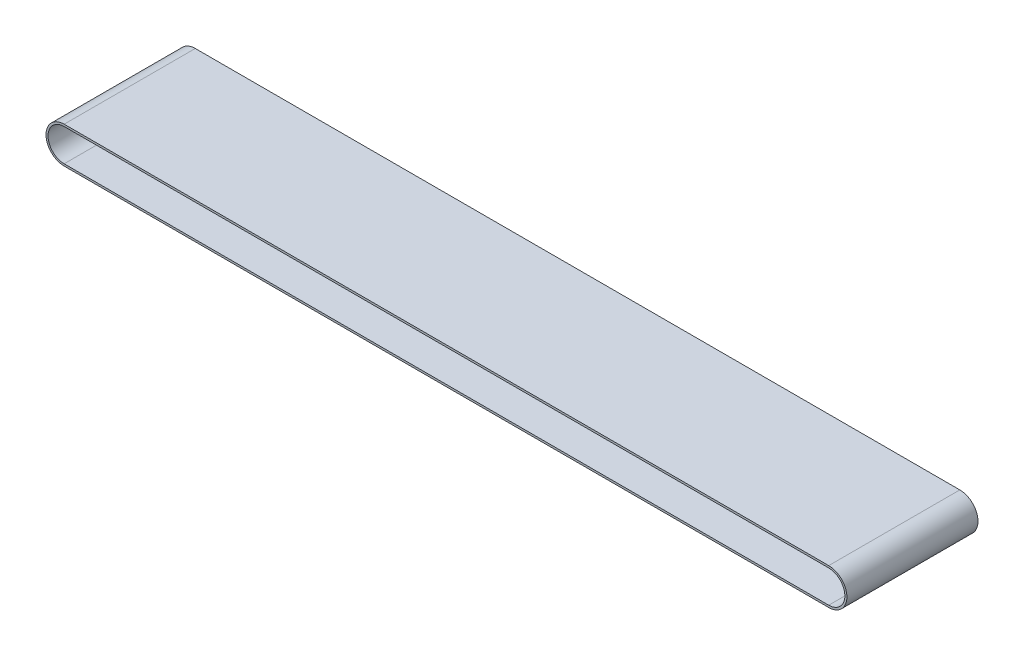
ISO-10303-21;
HEADER;
FILE_DESCRIPTION(('STEP AP214'),'2;1');
FILE_NAME('part.step','',(''),(''),'','','');
FILE_SCHEMA(('AUTOMOTIVE_DESIGN { 1 0 10303 214 1 1 1 1 }'));
ENDSEC;
DATA;
#1=APPLICATION_CONTEXT('core data for automotive mechanical design processes');
#2=APPLICATION_PROTOCOL_DEFINITION('international standard','automotive_design',2000,#1);
#3=PRODUCT_CONTEXT('',#1,'mechanical');
#4=PRODUCT('Part','Part','',(#3));
#5=PRODUCT_RELATED_PRODUCT_CATEGORY('part','',(#4));
#6=PRODUCT_DEFINITION_FORMATION('','',#4);
#7=PRODUCT_DEFINITION_CONTEXT('part definition',#1,'design');
#8=PRODUCT_DEFINITION('design','',#6,#7);
#9=PRODUCT_DEFINITION_SHAPE('','',#8);
#10=(LENGTH_UNIT() NAMED_UNIT(*) SI_UNIT(.MILLI.,.METRE.));
#11=(NAMED_UNIT(*) PLANE_ANGLE_UNIT() SI_UNIT($,.RADIAN.));
#12=(NAMED_UNIT(*) SI_UNIT($,.STERADIAN.) SOLID_ANGLE_UNIT());
#13=UNCERTAINTY_MEASURE_WITH_UNIT(LENGTH_MEASURE(1.E-05),#10,'distance_accuracy_value','');
#14=(GEOMETRIC_REPRESENTATION_CONTEXT(3) GLOBAL_UNCERTAINTY_ASSIGNED_CONTEXT((#13)) GLOBAL_UNIT_ASSIGNED_CONTEXT((#10,
#11,#12)) REPRESENTATION_CONTEXT('',''));
#15=CARTESIAN_POINT('',(0.,0.,0.));
#16=DIRECTION('',(0.,0.,1.));
#17=DIRECTION('',(1.,0.,0.));
#18=AXIS2_PLACEMENT_3D('',#15,#16,#17);
#19=CARTESIAN_POINT('',(0.,-16.,130.));
#20=DIRECTION('',(0.,0.,1.));
#21=DIRECTION('',(1.,0.,0.));
#22=AXIS2_PLACEMENT_3D('',#19,#20,#21);
#23=PLANE('',#22);
#24=CARTESIAN_POINT('',(0.,-16.,130.));
#25=DIRECTION('',(0.,0.,1.));
#26=DIRECTION('',(1.,0.,0.));
#27=AXIS2_PLACEMENT_3D('',#24,#25,#26);
#28=CIRCLE('',#27,18.);
#29=CARTESIAN_POINT('',(0.,2.,130.));
#30=VERTEX_POINT('',#29);
#31=CARTESIAN_POINT('',(0.,-34.,130.));
#32=VERTEX_POINT('',#31);
#33=EDGE_CURVE('E146',#30,#32,#28,.T.);
#34=ORIENTED_EDGE('',*,*,#33,.T.);
#35=DIRECTION('',(1.,0.,0.));
#36=VECTOR('',#35,1.);
#37=CARTESIAN_POINT('',(0.,-34.,130.));
#38=LINE('',#37,#36);
#39=CARTESIAN_POINT('',(758.,-34.,130.));
#40=VERTEX_POINT('',#39);
#41=EDGE_CURVE('E149',#32,#40,#38,.T.);
#42=ORIENTED_EDGE('',*,*,#41,.T.);
#43=CARTESIAN_POINT('',(758.,-16.,130.));
#44=DIRECTION('',(0.,0.,1.));
#45=DIRECTION('',(-1.,0.,0.));
#46=AXIS2_PLACEMENT_3D('',#43,#44,#45);
#47=CIRCLE('',#46,18.);
#48=CARTESIAN_POINT('',(758.,1.99999999999999,130.));
#49=VERTEX_POINT('',#48);
#50=EDGE_CURVE('E152',#40,#49,#47,.T.);
#51=ORIENTED_EDGE('',*,*,#50,.T.);
#52=DIRECTION('',(-1.,0.,0.));
#53=VECTOR('',#52,1.);
#54=CARTESIAN_POINT('',(0.,2.,130.));
#55=LINE('',#54,#53);
#56=EDGE_CURVE('E154',#49,#30,#55,.T.);
#57=ORIENTED_EDGE('',*,*,#56,.T.);
#58=EDGE_LOOP('',(#34,#42,#51,#57));
#59=FACE_BOUND('',#58,.T.);
#60=DIRECTION('',(1.,0.,0.));
#61=VECTOR('',#60,1.);
#62=CARTESIAN_POINT('',(0.,-32.,130.));
#63=LINE('',#62,#61);
#64=CARTESIAN_POINT('',(0.,-32.,130.));
#65=VERTEX_POINT('',#64);
#66=CARTESIAN_POINT('',(758.,-32.,130.));
#67=VERTEX_POINT('',#66);
#68=EDGE_CURVE('E118',#65,#67,#63,.T.);
#69=ORIENTED_EDGE('',*,*,#68,.F.);
#70=CARTESIAN_POINT('',(0.,-16.,130.));
#71=DIRECTION('',(0.,0.,1.));
#72=DIRECTION('',(1.,0.,0.));
#73=AXIS2_PLACEMENT_3D('',#70,#71,#72);
#74=CIRCLE('',#73,16.);
#75=CARTESIAN_POINT('',(0.,0.,130.));
#76=VERTEX_POINT('',#75);
#77=EDGE_CURVE('E110',#76,#65,#74,.T.);
#78=ORIENTED_EDGE('',*,*,#77,.F.);
#79=DIRECTION('',(-1.,0.,0.));
#80=VECTOR('',#79,1.);
#81=CARTESIAN_POINT('',(0.,0.,130.));
#82=LINE('',#81,#80);
#83=CARTESIAN_POINT('',(758.,0.,130.));
#84=VERTEX_POINT('',#83);
#85=EDGE_CURVE('E132',#84,#76,#82,.T.);
#86=ORIENTED_EDGE('',*,*,#85,.F.);
#87=CARTESIAN_POINT('',(758.,-16.,130.));
#88=DIRECTION('',(0.,0.,1.));
#89=DIRECTION('',(-1.,0.,0.));
#90=AXIS2_PLACEMENT_3D('',#87,#88,#89);
#91=CIRCLE('',#90,16.);
#92=EDGE_CURVE('E130',#67,#84,#91,.T.);
#93=ORIENTED_EDGE('',*,*,#92,.F.);
#94=EDGE_LOOP('',(#69,#78,#86,#93));
#95=FACE_BOUND('',#94,.T.);
#96=ADVANCED_FACE('F45',(#59,#95),#23,.T.);
#97=CARTESIAN_POINT('',(0.,-16.,0.));
#98=DIRECTION('',(0.,0.,1.));
#99=DIRECTION('',(1.,0.,0.));
#100=AXIS2_PLACEMENT_3D('',#97,#98,#99);
#101=PLANE('',#100);
#102=CARTESIAN_POINT('',(0.,-16.,0.));
#103=DIRECTION('',(0.,0.,1.));
#104=DIRECTION('',(1.,0.,0.));
#105=AXIS2_PLACEMENT_3D('',#102,#103,#104);
#106=CIRCLE('',#105,18.);
#107=CARTESIAN_POINT('',(0.,2.,0.));
#108=VERTEX_POINT('',#107);
#109=CARTESIAN_POINT('',(0.,-34.,0.));
#110=VERTEX_POINT('',#109);
#111=EDGE_CURVE('E126',#108,#110,#106,.T.);
#112=ORIENTED_EDGE('',*,*,#111,.F.);
#113=DIRECTION('',(-1.,0.,0.));
#114=VECTOR('',#113,1.);
#115=CARTESIAN_POINT('',(0.,2.,0.));
#116=LINE('',#115,#114);
#117=CARTESIAN_POINT('',(758.,1.99999999999999,0.));
#118=VERTEX_POINT('',#117);
#119=EDGE_CURVE('E150',#118,#108,#116,.T.);
#120=ORIENTED_EDGE('',*,*,#119,.F.);
#121=CARTESIAN_POINT('',(758.,-16.,0.));
#122=DIRECTION('',(0.,0.,1.));
#123=DIRECTION('',(-1.,0.,0.));
#124=AXIS2_PLACEMENT_3D('',#121,#122,#123);
#125=CIRCLE('',#124,18.);
#126=CARTESIAN_POINT('',(758.,-34.,0.));
#127=VERTEX_POINT('',#126);
#128=EDGE_CURVE('E161',#127,#118,#125,.T.);
#129=ORIENTED_EDGE('',*,*,#128,.F.);
#130=DIRECTION('',(1.,0.,0.));
#131=VECTOR('',#130,1.);
#132=CARTESIAN_POINT('',(0.,-34.,0.));
#133=LINE('',#132,#131);
#134=EDGE_CURVE('E159',#110,#127,#133,.T.);
#135=ORIENTED_EDGE('',*,*,#134,.F.);
#136=EDGE_LOOP('',(#112,#120,#129,#135));
#137=FACE_BOUND('',#136,.T.);
#138=CARTESIAN_POINT('',(0.,-16.,0.));
#139=DIRECTION('',(0.,0.,1.));
#140=DIRECTION('',(1.,0.,0.));
#141=AXIS2_PLACEMENT_3D('',#138,#139,#140);
#142=CIRCLE('',#141,16.);
#143=CARTESIAN_POINT('',(0.,0.,0.));
#144=VERTEX_POINT('',#143);
#145=CARTESIAN_POINT('',(0.,-32.,0.));
#146=VERTEX_POINT('',#145);
#147=EDGE_CURVE('E68',#144,#146,#142,.T.);
#148=ORIENTED_EDGE('',*,*,#147,.T.);
#149=DIRECTION('',(1.,0.,0.));
#150=VECTOR('',#149,1.);
#151=CARTESIAN_POINT('',(0.,-32.,0.));
#152=LINE('',#151,#150);
#153=CARTESIAN_POINT('',(758.,-32.,0.));
#154=VERTEX_POINT('',#153);
#155=EDGE_CURVE('E125',#146,#154,#152,.T.);
#156=ORIENTED_EDGE('',*,*,#155,.T.);
#157=CARTESIAN_POINT('',(758.,-16.,0.));
#158=DIRECTION('',(0.,0.,1.));
#159=DIRECTION('',(-1.,0.,0.));
#160=AXIS2_PLACEMENT_3D('',#157,#158,#159);
#161=CIRCLE('',#160,16.);
#162=CARTESIAN_POINT('',(758.,0.,0.));
#163=VERTEX_POINT('',#162);
#164=EDGE_CURVE('E138',#154,#163,#161,.T.);
#165=ORIENTED_EDGE('',*,*,#164,.T.);
#166=DIRECTION('',(-1.,0.,0.));
#167=VECTOR('',#166,1.);
#168=CARTESIAN_POINT('',(0.,0.,0.));
#169=LINE('',#168,#167);
#170=EDGE_CURVE('E119',#163,#144,#169,.T.);
#171=ORIENTED_EDGE('',*,*,#170,.T.);
#172=EDGE_LOOP('',(#148,#156,#165,#171));
#173=FACE_BOUND('',#172,.T.);
#174=ADVANCED_FACE('F179',(#137,#173),#101,.F.);
#175=CARTESIAN_POINT('',(0.,-16.,130.));
#176=DIRECTION('',(0.,0.,-1.));
#177=DIRECTION('',(-1.,0.,0.));
#178=AXIS2_PLACEMENT_3D('',#175,#176,#177);
#179=CYLINDRICAL_SURFACE('',#178,18.);
#180=ORIENTED_EDGE('',*,*,#111,.T.);
#181=DIRECTION('',(0.,0.,-1.));
#182=VECTOR('',#181,1.);
#183=CARTESIAN_POINT('',(0.,-34.,130.));
#184=LINE('',#183,#182);
#185=EDGE_CURVE('E11',#32,#110,#184,.T.);
#186=ORIENTED_EDGE('',*,*,#185,.F.);
#187=ORIENTED_EDGE('',*,*,#33,.F.);
#188=DIRECTION('',(0.,0.,-1.));
#189=VECTOR('',#188,1.);
#190=CARTESIAN_POINT('',(0.,2.,130.));
#191=LINE('',#190,#189);
#192=EDGE_CURVE('E156',#30,#108,#191,.T.);
#193=ORIENTED_EDGE('',*,*,#192,.T.);
#194=EDGE_LOOP('',(#180,#186,#187,#193));
#195=FACE_BOUND('',#194,.T.);
#196=ADVANCED_FACE('F47',(#195),#179,.T.);
#197=CARTESIAN_POINT('',(0.,-34.,130.));
#198=DIRECTION('',(0.,1.,0.));
#199=DIRECTION('',(-1.,0.,0.));
#200=AXIS2_PLACEMENT_3D('',#197,#198,#199);
#201=PLANE('',#200);
#202=ORIENTED_EDGE('',*,*,#134,.T.);
#203=DIRECTION('',(0.,0.,-1.));
#204=VECTOR('',#203,1.);
#205=CARTESIAN_POINT('',(758.,-34.,130.));
#206=LINE('',#205,#204);
#207=EDGE_CURVE('E53',#40,#127,#206,.T.);
#208=ORIENTED_EDGE('',*,*,#207,.F.);
#209=ORIENTED_EDGE('',*,*,#41,.F.);
#210=ORIENTED_EDGE('',*,*,#185,.T.);
#211=EDGE_LOOP('',(#202,#208,#209,#210));
#212=FACE_BOUND('',#211,.T.);
#213=ADVANCED_FACE('F189',(#212),#201,.F.);
#214=CARTESIAN_POINT('',(758.,-16.,130.));
#215=DIRECTION('',(0.,0.,-1.));
#216=DIRECTION('',(-1.,0.,0.));
#217=AXIS2_PLACEMENT_3D('',#214,#215,#216);
#218=CYLINDRICAL_SURFACE('',#217,18.);
#219=ORIENTED_EDGE('',*,*,#128,.T.);
#220=DIRECTION('',(0.,0.,-1.));
#221=VECTOR('',#220,1.);
#222=CARTESIAN_POINT('',(758.,1.99999999999999,130.));
#223=LINE('',#222,#221);
#224=EDGE_CURVE('E166',#49,#118,#223,.T.);
#225=ORIENTED_EDGE('',*,*,#224,.F.);
#226=ORIENTED_EDGE('',*,*,#50,.F.);
#227=ORIENTED_EDGE('',*,*,#207,.T.);
#228=EDGE_LOOP('',(#219,#225,#226,#227));
#229=FACE_BOUND('',#228,.T.);
#230=ADVANCED_FACE('F173',(#229),#218,.T.);
#231=CARTESIAN_POINT('',(0.,2.,130.));
#232=DIRECTION('',(0.,-1.,0.));
#233=DIRECTION('',(1.,0.,0.));
#234=AXIS2_PLACEMENT_3D('',#231,#232,#233);
#235=PLANE('',#234);
#236=ORIENTED_EDGE('',*,*,#119,.T.);
#237=ORIENTED_EDGE('',*,*,#192,.F.);
#238=ORIENTED_EDGE('',*,*,#56,.F.);
#239=ORIENTED_EDGE('',*,*,#224,.T.);
#240=EDGE_LOOP('',(#236,#237,#238,#239));
#241=FACE_BOUND('',#240,.T.);
#242=ADVANCED_FACE('F183',(#241),#235,.F.);
#243=CARTESIAN_POINT('',(0.,-16.,130.));
#244=DIRECTION('',(0.,0.,-1.));
#245=DIRECTION('',(-1.,0.,0.));
#246=AXIS2_PLACEMENT_3D('',#243,#244,#245);
#247=CYLINDRICAL_SURFACE('',#246,16.);
#248=ORIENTED_EDGE('',*,*,#147,.F.);
#249=DIRECTION('',(0.,0.,-1.));
#250=VECTOR('',#249,1.);
#251=CARTESIAN_POINT('',(0.,0.,130.));
#252=LINE('',#251,#250);
#253=EDGE_CURVE('E114',#76,#144,#252,.T.);
#254=ORIENTED_EDGE('',*,*,#253,.F.);
#255=ORIENTED_EDGE('',*,*,#77,.T.);
#256=DIRECTION('',(0.,0.,-1.));
#257=VECTOR('',#256,1.);
#258=CARTESIAN_POINT('',(0.,-32.,130.));
#259=LINE('',#258,#257);
#260=EDGE_CURVE('E113',#65,#146,#259,.T.);
#261=ORIENTED_EDGE('',*,*,#260,.T.);
#262=EDGE_LOOP('',(#248,#254,#255,#261));
#263=FACE_BOUND('',#262,.T.);
#264=ADVANCED_FACE('F112',(#263),#247,.F.);
#265=CARTESIAN_POINT('',(0.,-32.,130.));
#266=DIRECTION('',(0.,1.,0.));
#267=DIRECTION('',(0.,0.,1.));
#268=AXIS2_PLACEMENT_3D('',#265,#266,#267);
#269=PLANE('',#268);
#270=ORIENTED_EDGE('',*,*,#155,.F.);
#271=ORIENTED_EDGE('',*,*,#260,.F.);
#272=ORIENTED_EDGE('',*,*,#68,.T.);
#273=DIRECTION('',(0.,0.,-1.));
#274=VECTOR('',#273,1.);
#275=CARTESIAN_POINT('',(758.,-32.,130.));
#276=LINE('',#275,#274);
#277=EDGE_CURVE('E127',#67,#154,#276,.T.);
#278=ORIENTED_EDGE('',*,*,#277,.T.);
#279=EDGE_LOOP('',(#270,#271,#272,#278));
#280=FACE_BOUND('',#279,.T.);
#281=ADVANCED_FACE('F122',(#280),#269,.T.);
#282=CARTESIAN_POINT('',(758.,-16.,130.));
#283=DIRECTION('',(0.,0.,-1.));
#284=DIRECTION('',(-1.,0.,0.));
#285=AXIS2_PLACEMENT_3D('',#282,#283,#284);
#286=CYLINDRICAL_SURFACE('',#285,16.);
#287=ORIENTED_EDGE('',*,*,#164,.F.);
#288=ORIENTED_EDGE('',*,*,#277,.F.);
#289=ORIENTED_EDGE('',*,*,#92,.T.);
#290=DIRECTION('',(0.,0.,-1.));
#291=VECTOR('',#290,1.);
#292=CARTESIAN_POINT('',(758.,0.,130.));
#293=LINE('',#292,#291);
#294=EDGE_CURVE('E60',#84,#163,#293,.T.);
#295=ORIENTED_EDGE('',*,*,#294,.T.);
#296=EDGE_LOOP('',(#287,#288,#289,#295));
#297=FACE_BOUND('',#296,.T.);
#298=ADVANCED_FACE('F213',(#297),#286,.F.);
#299=CARTESIAN_POINT('',(0.,0.,130.));
#300=DIRECTION('',(0.,-1.,0.));
#301=DIRECTION('',(1.,0.,0.));
#302=AXIS2_PLACEMENT_3D('',#299,#300,#301);
#303=PLANE('',#302);
#304=ORIENTED_EDGE('',*,*,#170,.F.);
#305=ORIENTED_EDGE('',*,*,#294,.F.);
#306=ORIENTED_EDGE('',*,*,#85,.T.);
#307=ORIENTED_EDGE('',*,*,#253,.T.);
#308=EDGE_LOOP('',(#304,#305,#306,#307));
#309=FACE_BOUND('',#308,.T.);
#310=ADVANCED_FACE('F217',(#309),#303,.T.);
#311=CLOSED_SHELL('',(#96,#174,#196,#213,#230,#242,#264,#281,#298,#310));
#312=MANIFOLD_SOLID_BREP('B2',#311);
#313=ADVANCED_BREP_SHAPE_REPRESENTATION('',(#18,#312),#14);
#314=SHAPE_DEFINITION_REPRESENTATION(#9,#313);
ENDSEC;
END-ISO-10303-21;
